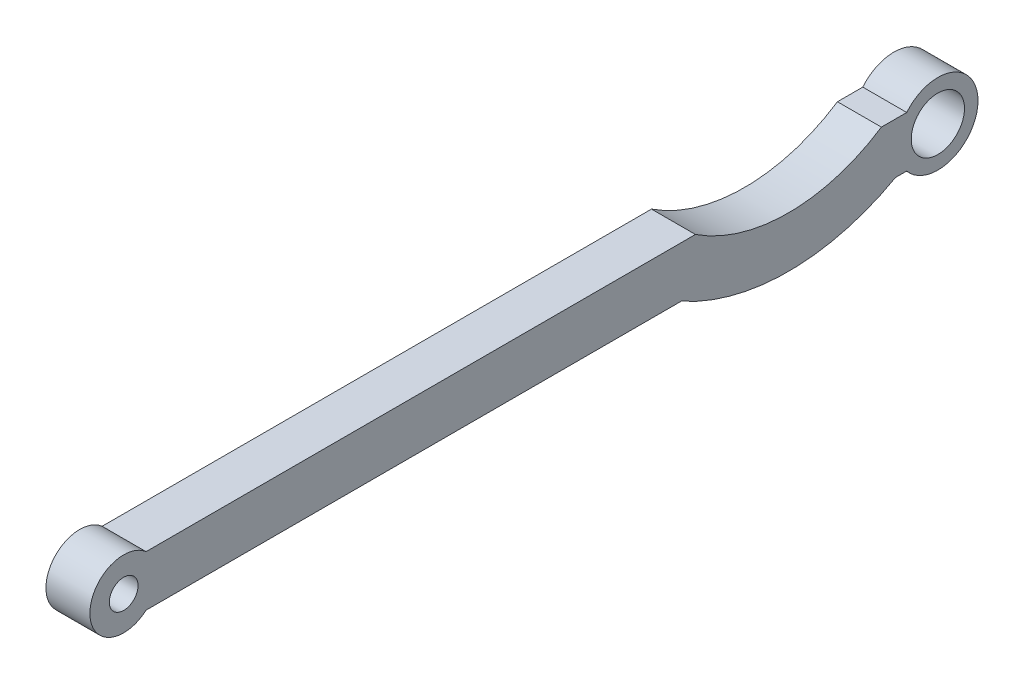
ISO-10303-21;
HEADER;
FILE_DESCRIPTION(('STEP AP214'),'2;1');
FILE_NAME('part.step','',(''),(''),'','','');
FILE_SCHEMA(('AUTOMOTIVE_DESIGN { 1 0 10303 214 1 1 1 1 }'));
ENDSEC;
DATA;
#1=APPLICATION_CONTEXT('core data for automotive mechanical design processes');
#2=APPLICATION_PROTOCOL_DEFINITION('international standard','automotive_design',2000,#1);
#3=PRODUCT_CONTEXT('',#1,'mechanical');
#4=PRODUCT('Part','Part','',(#3));
#5=PRODUCT_RELATED_PRODUCT_CATEGORY('part','',(#4));
#6=PRODUCT_DEFINITION_FORMATION('','',#4);
#7=PRODUCT_DEFINITION_CONTEXT('part definition',#1,'design');
#8=PRODUCT_DEFINITION('design','',#6,#7);
#9=PRODUCT_DEFINITION_SHAPE('','',#8);
#10=(LENGTH_UNIT() NAMED_UNIT(*) SI_UNIT(.MILLI.,.METRE.));
#11=(NAMED_UNIT(*) PLANE_ANGLE_UNIT() SI_UNIT($,.RADIAN.));
#12=(NAMED_UNIT(*) SI_UNIT($,.STERADIAN.) SOLID_ANGLE_UNIT());
#13=UNCERTAINTY_MEASURE_WITH_UNIT(LENGTH_MEASURE(1.E-05),#10,'distance_accuracy_value','');
#14=(GEOMETRIC_REPRESENTATION_CONTEXT(3) GLOBAL_UNCERTAINTY_ASSIGNED_CONTEXT((#13)) GLOBAL_UNIT_ASSIGNED_CONTEXT((#10,
#11,#12)) REPRESENTATION_CONTEXT('',''));
#15=CARTESIAN_POINT('',(0.,0.,0.));
#16=DIRECTION('',(0.,0.,1.));
#17=DIRECTION('',(1.,0.,0.));
#18=AXIS2_PLACEMENT_3D('',#15,#16,#17);
#19=CARTESIAN_POINT('',(5.2,0.,54.417601355068));
#20=DIRECTION('',(1.,0.,0.));
#21=DIRECTION('',(0.,0.,-1.));
#22=AXIS2_PLACEMENT_3D('',#19,#20,#21);
#23=PLANE('',#22);
#24=CARTESIAN_POINT('',(5.2,0.,-41.9108799216606));
#25=DIRECTION('',(1.,0.,0.));
#26=DIRECTION('',(0.,0.,-1.));
#27=AXIS2_PLACEMENT_3D('',#24,#25,#26);
#28=CIRCLE('',#27,3.15);
#29=CARTESIAN_POINT('',(5.2,0.,-45.0608799216606));
#30=VERTEX_POINT('',#29);
#31=EDGE_CURVE('E152',#30,#30,#28,.T.);
#32=ORIENTED_EDGE('',*,*,#31,.F.);
#33=EDGE_LOOP('',(#32));
#34=FACE_BOUND('',#33,.T.);
#35=CARTESIAN_POINT('',(5.2,0.,54.417601355068));
#36=DIRECTION('',(1.,0.,0.));
#37=DIRECTION('',(0.,0.,-1.));
#38=AXIS2_PLACEMENT_3D('',#35,#36,#37);
#39=CIRCLE('',#38,4.);
#40=CARTESIAN_POINT('',(5.2,3.00000000000001,51.7718500440035));
#41=VERTEX_POINT('',#40);
#42=CARTESIAN_POINT('',(5.2,-2.99999999999999,51.7718500440035));
#43=VERTEX_POINT('',#42);
#44=EDGE_CURVE('E170',#41,#43,#39,.T.);
#45=ORIENTED_EDGE('',*,*,#44,.T.);
#46=DIRECTION('',(0.,0.,-1.));
#47=VECTOR('',#46,1.);
#48=CARTESIAN_POINT('',(5.2,-2.99999999999999,51.7718500440035));
#49=LINE('',#48,#47);
#50=CARTESIAN_POINT('',(5.2,-3.00000000000001,-11.5569036503595));
#51=VERTEX_POINT('',#50);
#52=EDGE_CURVE('E106',#43,#51,#49,.T.);
#53=ORIENTED_EDGE('',*,*,#52,.T.);
#54=CARTESIAN_POINT('',(5.2,19.7032930884901,-24.2281499559965));
#55=DIRECTION('',(1.,0.,0.));
#56=DIRECTION('',(0.,0.,-1.));
#57=AXIS2_PLACEMENT_3D('',#54,#55,#56);
#58=CIRCLE('',#57,26.);
#59=CARTESIAN_POINT('',(5.2,-3.00000000000001,-36.8993962616335));
#60=VERTEX_POINT('',#59);
#61=EDGE_CURVE('E191',#51,#60,#58,.T.);
#62=ORIENTED_EDGE('',*,*,#61,.T.);
#63=DIRECTION('',(0.,0.,-1.));
#64=VECTOR('',#63,1.);
#65=CARTESIAN_POINT('',(5.2,-2.99999999999999,-38.2281499559965));
#66=LINE('',#65,#64);
#67=CARTESIAN_POINT('',(5.2,-2.99999999999999,-38.2281499559965));
#68=VERTEX_POINT('',#67);
#69=EDGE_CURVE('E205',#60,#68,#66,.T.);
#70=ORIENTED_EDGE('',*,*,#69,.T.);
#71=CARTESIAN_POINT('',(5.2,0.,-41.9108799216606));
#72=DIRECTION('',(1.,0.,0.));
#73=DIRECTION('',(0.,0.,-1.));
#74=AXIS2_PLACEMENT_3D('',#71,#72,#73);
#75=CIRCLE('',#74,4.74999999999999);
#76=CARTESIAN_POINT('',(5.2,3.00000000000001,-38.2281499559965));
#77=VERTEX_POINT('',#76);
#78=EDGE_CURVE('E125',#68,#77,#75,.T.);
#79=ORIENTED_EDGE('',*,*,#78,.T.);
#80=DIRECTION('',(0.,0.,1.));
#81=VECTOR('',#80,1.);
#82=CARTESIAN_POINT('',(5.2,2.99999999999999,-35.2281499559965));
#83=LINE('',#82,#81);
#84=CARTESIAN_POINT('',(5.2,2.99999999999999,-35.2281499559965));
#85=VERTEX_POINT('',#84);
#86=EDGE_CURVE('E119',#77,#85,#83,.T.);
#87=ORIENTED_EDGE('',*,*,#86,.T.);
#88=CARTESIAN_POINT('',(5.2,19.7032930884901,-24.2281499559965));
#89=DIRECTION('',(-1.,0.,0.));
#90=DIRECTION('',(0.,0.,1.));
#91=AXIS2_PLACEMENT_3D('',#88,#89,#90);
#92=CIRCLE('',#91,20.);
#93=CARTESIAN_POINT('',(5.2,2.99999999999999,-13.2281499559965));
#94=VERTEX_POINT('',#93);
#95=EDGE_CURVE('E123',#85,#94,#92,.T.);
#96=ORIENTED_EDGE('',*,*,#95,.T.);
#97=DIRECTION('',(0.,0.,1.));
#98=VECTOR('',#97,1.);
#99=CARTESIAN_POINT('',(5.2,3.00000000000001,51.7718500440035));
#100=LINE('',#99,#98);
#101=EDGE_CURVE('E63',#94,#41,#100,.T.);
#102=ORIENTED_EDGE('',*,*,#101,.T.);
#103=EDGE_LOOP('',(#45,#53,#62,#70,#79,#87,#96,#102));
#104=FACE_BOUND('',#103,.T.);
#105=CARTESIAN_POINT('',(5.2,0.,54.417601355068));
#106=DIRECTION('',(1.,0.,0.));
#107=DIRECTION('',(0.,0.,-1.));
#108=AXIS2_PLACEMENT_3D('',#105,#106,#107);
#109=CIRCLE('',#108,1.7);
#110=CARTESIAN_POINT('',(5.2,0.,52.717601355068));
#111=VERTEX_POINT('',#110);
#112=EDGE_CURVE('E219',#111,#111,#109,.T.);
#113=ORIENTED_EDGE('',*,*,#112,.F.);
#114=EDGE_LOOP('',(#113));
#115=FACE_BOUND('',#114,.T.);
#116=ADVANCED_FACE('F45',(#34,#104,#115),#23,.T.);
#117=CARTESIAN_POINT('',(0.,0.,54.417601355068));
#118=DIRECTION('',(1.,0.,0.));
#119=DIRECTION('',(0.,0.,-1.));
#120=AXIS2_PLACEMENT_3D('',#117,#118,#119);
#121=PLANE('',#120);
#122=CARTESIAN_POINT('',(0.,0.,54.417601355068));
#123=DIRECTION('',(1.,0.,0.));
#124=DIRECTION('',(0.,0.,-1.));
#125=AXIS2_PLACEMENT_3D('',#122,#123,#124);
#126=CIRCLE('',#125,4.);
#127=CARTESIAN_POINT('',(0.,3.00000000000001,51.7718500440035));
#128=VERTEX_POINT('',#127);
#129=CARTESIAN_POINT('',(0.,-2.99999999999999,51.7718500440035));
#130=VERTEX_POINT('',#129);
#131=EDGE_CURVE('E147',#128,#130,#126,.T.);
#132=ORIENTED_EDGE('',*,*,#131,.F.);
#133=DIRECTION('',(0.,0.,1.));
#134=VECTOR('',#133,1.);
#135=CARTESIAN_POINT('',(0.,3.00000000000001,51.7718500440035));
#136=LINE('',#135,#134);
#137=CARTESIAN_POINT('',(0.,2.99999999999999,-13.2281499559965));
#138=VERTEX_POINT('',#137);
#139=EDGE_CURVE('E98',#138,#128,#136,.T.);
#140=ORIENTED_EDGE('',*,*,#139,.F.);
#141=CARTESIAN_POINT('',(0.,19.7032930884901,-24.2281499559965));
#142=DIRECTION('',(-1.,0.,0.));
#143=DIRECTION('',(0.,0.,1.));
#144=AXIS2_PLACEMENT_3D('',#141,#142,#143);
#145=CIRCLE('',#144,20.);
#146=CARTESIAN_POINT('',(0.,2.99999999999999,-35.2281499559965));
#147=VERTEX_POINT('',#146);
#148=EDGE_CURVE('E92',#147,#138,#145,.T.);
#149=ORIENTED_EDGE('',*,*,#148,.F.);
#150=DIRECTION('',(0.,0.,1.));
#151=VECTOR('',#150,1.);
#152=CARTESIAN_POINT('',(0.,2.99999999999999,-35.2281499559965));
#153=LINE('',#152,#151);
#154=CARTESIAN_POINT('',(0.,3.00000000000001,-38.2281499559965));
#155=VERTEX_POINT('',#154);
#156=EDGE_CURVE('E134',#155,#147,#153,.T.);
#157=ORIENTED_EDGE('',*,*,#156,.F.);
#158=CARTESIAN_POINT('',(0.,0.,-41.9108799216606));
#159=DIRECTION('',(1.,0.,0.));
#160=DIRECTION('',(0.,0.,-1.));
#161=AXIS2_PLACEMENT_3D('',#158,#159,#160);
#162=CIRCLE('',#161,4.74999999999999);
#163=CARTESIAN_POINT('',(0.,-2.99999999999999,-38.2281499559965));
#164=VERTEX_POINT('',#163);
#165=EDGE_CURVE('E161',#164,#155,#162,.T.);
#166=ORIENTED_EDGE('',*,*,#165,.F.);
#167=DIRECTION('',(0.,0.,-1.));
#168=VECTOR('',#167,1.);
#169=CARTESIAN_POINT('',(0.,-2.99999999999999,-38.2281499559965));
#170=LINE('',#169,#168);
#171=CARTESIAN_POINT('',(0.,-3.00000000000001,-36.8993962616335));
#172=VERTEX_POINT('',#171);
#173=EDGE_CURVE('E158',#172,#164,#170,.T.);
#174=ORIENTED_EDGE('',*,*,#173,.F.);
#175=CARTESIAN_POINT('',(0.,19.7032930884901,-24.2281499559965));
#176=DIRECTION('',(1.,0.,0.));
#177=DIRECTION('',(0.,0.,-1.));
#178=AXIS2_PLACEMENT_3D('',#175,#176,#177);
#179=CIRCLE('',#178,26.);
#180=CARTESIAN_POINT('',(0.,-3.00000000000001,-11.5569036503595));
#181=VERTEX_POINT('',#180);
#182=EDGE_CURVE('E155',#181,#172,#179,.T.);
#183=ORIENTED_EDGE('',*,*,#182,.F.);
#184=DIRECTION('',(0.,0.,-1.));
#185=VECTOR('',#184,1.);
#186=CARTESIAN_POINT('',(0.,-2.99999999999999,51.7718500440035));
#187=LINE('',#186,#185);
#188=EDGE_CURVE('E151',#130,#181,#187,.T.);
#189=ORIENTED_EDGE('',*,*,#188,.F.);
#190=EDGE_LOOP('',(#132,#140,#149,#157,#166,#174,#183,#189));
#191=FACE_BOUND('',#190,.T.);
#192=CARTESIAN_POINT('',(0.,0.,-41.9108799216606));
#193=DIRECTION('',(1.,0.,0.));
#194=DIRECTION('',(0.,0.,-1.));
#195=AXIS2_PLACEMENT_3D('',#192,#193,#194);
#196=CIRCLE('',#195,3.15);
#197=CARTESIAN_POINT('',(0.,0.,-45.0608799216606));
#198=VERTEX_POINT('',#197);
#199=EDGE_CURVE('E215',#198,#198,#196,.T.);
#200=ORIENTED_EDGE('',*,*,#199,.T.);
#201=EDGE_LOOP('',(#200));
#202=FACE_BOUND('',#201,.T.);
#203=CARTESIAN_POINT('',(0.,0.,54.417601355068));
#204=DIRECTION('',(1.,0.,0.));
#205=DIRECTION('',(0.,0.,-1.));
#206=AXIS2_PLACEMENT_3D('',#203,#204,#205);
#207=CIRCLE('',#206,1.7);
#208=CARTESIAN_POINT('',(0.,0.,52.717601355068));
#209=VERTEX_POINT('',#208);
#210=EDGE_CURVE('E223',#209,#209,#207,.T.);
#211=ORIENTED_EDGE('',*,*,#210,.T.);
#212=EDGE_LOOP('',(#211));
#213=FACE_BOUND('',#212,.T.);
#214=ADVANCED_FACE('F195',(#191,#202,#213),#121,.F.);
#215=CARTESIAN_POINT('',(5.2,0.,54.417601355068));
#216=DIRECTION('',(-1.,0.,0.));
#217=DIRECTION('',(0.,0.,1.));
#218=AXIS2_PLACEMENT_3D('',#215,#216,#217);
#219=CYLINDRICAL_SURFACE('',#218,4.);
#220=ORIENTED_EDGE('',*,*,#131,.T.);
#221=DIRECTION('',(-1.,0.,0.));
#222=VECTOR('',#221,1.);
#223=CARTESIAN_POINT('',(5.2,-2.99999999999999,51.7718500440035));
#224=LINE('',#223,#222);
#225=EDGE_CURVE('E11',#43,#130,#224,.T.);
#226=ORIENTED_EDGE('',*,*,#225,.F.);
#227=ORIENTED_EDGE('',*,*,#44,.F.);
#228=DIRECTION('',(-1.,0.,0.));
#229=VECTOR('',#228,1.);
#230=CARTESIAN_POINT('',(5.2,3.00000000000001,51.7718500440035));
#231=LINE('',#230,#229);
#232=EDGE_CURVE('E143',#41,#128,#231,.T.);
#233=ORIENTED_EDGE('',*,*,#232,.T.);
#234=EDGE_LOOP('',(#220,#226,#227,#233));
#235=FACE_BOUND('',#234,.T.);
#236=ADVANCED_FACE('F47',(#235),#219,.T.);
#237=CARTESIAN_POINT('',(5.2,-2.99999999999999,51.7718500440035));
#238=DIRECTION('',(0.,1.,0.));
#239=DIRECTION('',(0.,0.,1.));
#240=AXIS2_PLACEMENT_3D('',#237,#238,#239);
#241=PLANE('',#240);
#242=ORIENTED_EDGE('',*,*,#188,.T.);
#243=DIRECTION('',(-1.,0.,0.));
#244=VECTOR('',#243,1.);
#245=CARTESIAN_POINT('',(5.2,-3.00000000000001,-11.5569036503595));
#246=LINE('',#245,#244);
#247=EDGE_CURVE('E55',#51,#181,#246,.T.);
#248=ORIENTED_EDGE('',*,*,#247,.F.);
#249=ORIENTED_EDGE('',*,*,#52,.F.);
#250=ORIENTED_EDGE('',*,*,#225,.T.);
#251=EDGE_LOOP('',(#242,#248,#249,#250));
#252=FACE_BOUND('',#251,.T.);
#253=ADVANCED_FACE('F257',(#252),#241,.F.);
#254=CARTESIAN_POINT('',(5.2,19.7032930884901,-24.2281499559965));
#255=DIRECTION('',(-1.,0.,0.));
#256=DIRECTION('',(0.,0.,1.));
#257=AXIS2_PLACEMENT_3D('',#254,#255,#256);
#258=CYLINDRICAL_SURFACE('',#257,26.);
#259=ORIENTED_EDGE('',*,*,#182,.T.);
#260=DIRECTION('',(-1.,0.,0.));
#261=VECTOR('',#260,1.);
#262=CARTESIAN_POINT('',(5.2,-3.00000000000001,-36.8993962616335));
#263=LINE('',#262,#261);
#264=EDGE_CURVE('E181',#60,#172,#263,.T.);
#265=ORIENTED_EDGE('',*,*,#264,.F.);
#266=ORIENTED_EDGE('',*,*,#61,.F.);
#267=ORIENTED_EDGE('',*,*,#247,.T.);
#268=EDGE_LOOP('',(#259,#265,#266,#267));
#269=FACE_BOUND('',#268,.T.);
#270=ADVANCED_FACE('F189',(#269),#258,.T.);
#271=CARTESIAN_POINT('',(5.2,-2.99999999999999,-38.2281499559965));
#272=DIRECTION('',(0.,1.,0.));
#273=DIRECTION('',(0.,0.,1.));
#274=AXIS2_PLACEMENT_3D('',#271,#272,#273);
#275=PLANE('',#274);
#276=ORIENTED_EDGE('',*,*,#173,.T.);
#277=DIRECTION('',(-1.,0.,0.));
#278=VECTOR('',#277,1.);
#279=CARTESIAN_POINT('',(5.2,-2.99999999999999,-38.2281499559965));
#280=LINE('',#279,#278);
#281=EDGE_CURVE('E177',#68,#164,#280,.T.);
#282=ORIENTED_EDGE('',*,*,#281,.F.);
#283=ORIENTED_EDGE('',*,*,#69,.F.);
#284=ORIENTED_EDGE('',*,*,#264,.T.);
#285=EDGE_LOOP('',(#276,#282,#283,#284));
#286=FACE_BOUND('',#285,.T.);
#287=ADVANCED_FACE('F200',(#286),#275,.F.);
#288=CARTESIAN_POINT('',(5.2,0.,-41.9108799216606));
#289=DIRECTION('',(-1.,0.,0.));
#290=DIRECTION('',(0.,0.,1.));
#291=AXIS2_PLACEMENT_3D('',#288,#289,#290);
#292=CYLINDRICAL_SURFACE('',#291,4.74999999999999);
#293=ORIENTED_EDGE('',*,*,#165,.T.);
#294=DIRECTION('',(-1.,0.,0.));
#295=VECTOR('',#294,1.);
#296=CARTESIAN_POINT('',(5.2,3.00000000000001,-38.2281499559965));
#297=LINE('',#296,#295);
#298=EDGE_CURVE('E136',#77,#155,#297,.T.);
#299=ORIENTED_EDGE('',*,*,#298,.F.);
#300=ORIENTED_EDGE('',*,*,#78,.F.);
#301=ORIENTED_EDGE('',*,*,#281,.T.);
#302=EDGE_LOOP('',(#293,#299,#300,#301));
#303=FACE_BOUND('',#302,.T.);
#304=ADVANCED_FACE('F203',(#303),#292,.T.);
#305=CARTESIAN_POINT('',(5.2,2.99999999999999,-35.2281499559965));
#306=DIRECTION('',(0.,-1.,0.));
#307=DIRECTION('',(0.,0.,-1.));
#308=AXIS2_PLACEMENT_3D('',#305,#306,#307);
#309=PLANE('',#308);
#310=ORIENTED_EDGE('',*,*,#156,.T.);
#311=DIRECTION('',(-1.,0.,0.));
#312=VECTOR('',#311,1.);
#313=CARTESIAN_POINT('',(5.2,2.99999999999999,-35.2281499559965));
#314=LINE('',#313,#312);
#315=EDGE_CURVE('E131',#85,#147,#314,.T.);
#316=ORIENTED_EDGE('',*,*,#315,.F.);
#317=ORIENTED_EDGE('',*,*,#86,.F.);
#318=ORIENTED_EDGE('',*,*,#298,.T.);
#319=EDGE_LOOP('',(#310,#316,#317,#318));
#320=FACE_BOUND('',#319,.T.);
#321=ADVANCED_FACE('F132',(#320),#309,.F.);
#322=CARTESIAN_POINT('',(5.2,19.7032930884901,-24.2281499559965));
#323=DIRECTION('',(-1.,0.,0.));
#324=DIRECTION('',(0.,0.,1.));
#325=AXIS2_PLACEMENT_3D('',#322,#323,#324);
#326=CYLINDRICAL_SURFACE('',#325,20.);
#327=ORIENTED_EDGE('',*,*,#148,.T.);
#328=DIRECTION('',(-1.,0.,0.));
#329=VECTOR('',#328,1.);
#330=CARTESIAN_POINT('',(5.2,2.99999999999999,-13.2281499559965));
#331=LINE('',#330,#329);
#332=EDGE_CURVE('E137',#94,#138,#331,.T.);
#333=ORIENTED_EDGE('',*,*,#332,.F.);
#334=ORIENTED_EDGE('',*,*,#95,.F.);
#335=ORIENTED_EDGE('',*,*,#315,.T.);
#336=EDGE_LOOP('',(#327,#333,#334,#335));
#337=FACE_BOUND('',#336,.T.);
#338=ADVANCED_FACE('F139',(#337),#326,.F.);
#339=CARTESIAN_POINT('',(5.2,3.00000000000001,51.7718500440035));
#340=DIRECTION('',(0.,-1.,0.));
#341=DIRECTION('',(0.,0.,-1.));
#342=AXIS2_PLACEMENT_3D('',#339,#340,#341);
#343=PLANE('',#342);
#344=ORIENTED_EDGE('',*,*,#139,.T.);
#345=ORIENTED_EDGE('',*,*,#232,.F.);
#346=ORIENTED_EDGE('',*,*,#101,.F.);
#347=ORIENTED_EDGE('',*,*,#332,.T.);
#348=EDGE_LOOP('',(#344,#345,#346,#347));
#349=FACE_BOUND('',#348,.T.);
#350=ADVANCED_FACE('F245',(#349),#343,.F.);
#351=CARTESIAN_POINT('',(5.2,0.,-41.9108799216606));
#352=DIRECTION('',(-1.,0.,0.));
#353=DIRECTION('',(0.,0.,1.));
#354=AXIS2_PLACEMENT_3D('',#351,#352,#353);
#355=CYLINDRICAL_SURFACE('',#354,3.15);
#356=ORIENTED_EDGE('',*,*,#31,.T.);
#357=EDGE_LOOP('',(#356));
#358=FACE_BOUND('',#357,.T.);
#359=ORIENTED_EDGE('',*,*,#199,.F.);
#360=EDGE_LOOP('',(#359));
#361=FACE_BOUND('',#360,.T.);
#362=ADVANCED_FACE('F242',(#358,#361),#355,.F.);
#363=CARTESIAN_POINT('',(5.2,0.,54.417601355068));
#364=DIRECTION('',(-1.,0.,0.));
#365=DIRECTION('',(0.,0.,1.));
#366=AXIS2_PLACEMENT_3D('',#363,#364,#365);
#367=CYLINDRICAL_SURFACE('',#366,1.7);
#368=ORIENTED_EDGE('',*,*,#112,.T.);
#369=EDGE_LOOP('',(#368));
#370=FACE_BOUND('',#369,.T.);
#371=ORIENTED_EDGE('',*,*,#210,.F.);
#372=EDGE_LOOP('',(#371));
#373=FACE_BOUND('',#372,.T.);
#374=ADVANCED_FACE('F231',(#370,#373),#367,.F.);
#375=CLOSED_SHELL('',(#116,#214,#236,#253,#270,#287,#304,#321,#338,#350,#362,#374));
#376=MANIFOLD_SOLID_BREP('B2',#375);
#377=ADVANCED_BREP_SHAPE_REPRESENTATION('',(#18,#376),#14);
#378=SHAPE_DEFINITION_REPRESENTATION(#9,#377);
ENDSEC;
END-ISO-10303-21;
